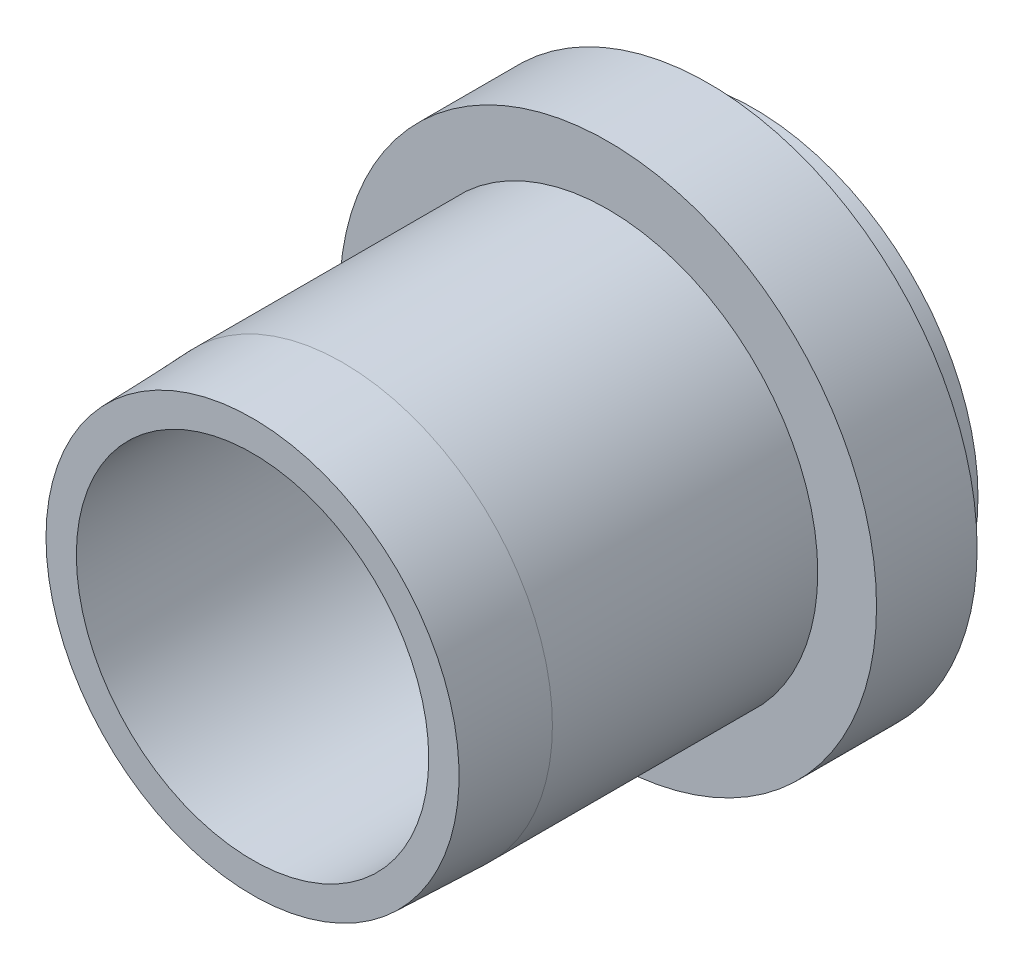
ISO-10303-21;
HEADER;
FILE_DESCRIPTION(('STEP AP214'),'2;1');
FILE_NAME('part.step','',(''),(''),'','','');
FILE_SCHEMA(('AUTOMOTIVE_DESIGN { 1 0 10303 214 1 1 1 1 }'));
ENDSEC;
DATA;
#1=APPLICATION_CONTEXT('core data for automotive mechanical design processes');
#2=APPLICATION_PROTOCOL_DEFINITION('international standard','automotive_design',2000,#1);
#3=PRODUCT_CONTEXT('',#1,'mechanical');
#4=PRODUCT('Part','Part','',(#3));
#5=PRODUCT_RELATED_PRODUCT_CATEGORY('part','',(#4));
#6=PRODUCT_DEFINITION_FORMATION('','',#4);
#7=PRODUCT_DEFINITION_CONTEXT('part definition',#1,'design');
#8=PRODUCT_DEFINITION('design','',#6,#7);
#9=PRODUCT_DEFINITION_SHAPE('','',#8);
#10=(LENGTH_UNIT() NAMED_UNIT(*) SI_UNIT(.MILLI.,.METRE.));
#11=(NAMED_UNIT(*) PLANE_ANGLE_UNIT() SI_UNIT($,.RADIAN.));
#12=(NAMED_UNIT(*) SI_UNIT($,.STERADIAN.) SOLID_ANGLE_UNIT());
#13=UNCERTAINTY_MEASURE_WITH_UNIT(LENGTH_MEASURE(1.E-05),#10,'distance_accuracy_value','');
#14=(GEOMETRIC_REPRESENTATION_CONTEXT(3) GLOBAL_UNCERTAINTY_ASSIGNED_CONTEXT((#13)) GLOBAL_UNIT_ASSIGNED_CONTEXT((#10,
#11,#12)) REPRESENTATION_CONTEXT('',''));
#15=CARTESIAN_POINT('',(0.,0.,0.));
#16=DIRECTION('',(0.,0.,1.));
#17=DIRECTION('',(1.,0.,0.));
#18=AXIS2_PLACEMENT_3D('',#15,#16,#17);
#19=CARTESIAN_POINT('',(0.,0.,14.45));
#20=DIRECTION('',(0.,0.,1.));
#21=DIRECTION('',(1.,0.,0.));
#22=AXIS2_PLACEMENT_3D('',#19,#20,#21);
#23=PLANE('',#22);
#24=CARTESIAN_POINT('',(0.,0.,14.45));
#25=DIRECTION('',(0.,0.,1.));
#26=DIRECTION('',(1.,0.,0.));
#27=AXIS2_PLACEMENT_3D('',#24,#25,#26);
#28=CIRCLE('',#27,5.08);
#29=CARTESIAN_POINT('',(5.08000000000001,0.,14.45));
#30=VERTEX_POINT('',#29);
#31=EDGE_CURVE('E58',#30,#30,#28,.T.);
#32=ORIENTED_EDGE('',*,*,#31,.F.);
#33=EDGE_LOOP('',(#32));
#34=FACE_BOUND('',#33,.T.);
#35=CARTESIAN_POINT('',(0.,0.,14.45));
#36=DIRECTION('',(0.,0.,-1.));
#37=DIRECTION('',(-1.,0.,0.));
#38=AXIS2_PLACEMENT_3D('',#35,#36,#37);
#39=CIRCLE('',#38,5.95440599932147);
#40=CARTESIAN_POINT('',(-5.95440599932147,0.,14.45));
#41=VERTEX_POINT('',#40);
#42=EDGE_CURVE('E122',#41,#41,#39,.T.);
#43=ORIENTED_EDGE('',*,*,#42,.F.);
#44=EDGE_LOOP('',(#43));
#45=FACE_BOUND('',#44,.T.);
#46=ADVANCED_FACE('F40',(#34,#45),#23,.T.);
#47=CARTESIAN_POINT('',(0.,0.,4.2));
#48=DIRECTION('',(0.,0.,-1.));
#49=DIRECTION('',(-1.,0.,0.));
#50=AXIS2_PLACEMENT_3D('',#47,#48,#49);
#51=CYLINDRICAL_SURFACE('',#50,6.465);
#52=CARTESIAN_POINT('',(0.,0.,0.));
#53=DIRECTION('',(0.,0.,1.));
#54=DIRECTION('',(1.,0.,0.));
#55=AXIS2_PLACEMENT_3D('',#52,#53,#54);
#56=CIRCLE('',#55,6.465);
#57=CARTESIAN_POINT('',(6.465,0.,0.));
#58=VERTEX_POINT('',#57);
#59=EDGE_CURVE('E55',#58,#58,#56,.T.);
#60=ORIENTED_EDGE('',*,*,#59,.T.);
#61=EDGE_LOOP('',(#60));
#62=FACE_BOUND('',#61,.T.);
#63=CARTESIAN_POINT('',(0.,0.,1.3));
#64=DIRECTION('',(0.,0.,1.));
#65=DIRECTION('',(1.,0.,0.));
#66=AXIS2_PLACEMENT_3D('',#63,#64,#65);
#67=CIRCLE('',#66,6.465);
#68=CARTESIAN_POINT('',(6.465,0.,1.3));
#69=VERTEX_POINT('',#68);
#70=EDGE_CURVE('E44',#69,#69,#67,.T.);
#71=ORIENTED_EDGE('',*,*,#70,.F.);
#72=EDGE_LOOP('',(#71));
#73=FACE_BOUND('',#72,.T.);
#74=ADVANCED_FACE('F42',(#62,#73),#51,.T.);
#75=CARTESIAN_POINT('',(0.,0.,0.));
#76=DIRECTION('',(0.,0.,1.));
#77=DIRECTION('',(1.,0.,0.));
#78=AXIS2_PLACEMENT_3D('',#75,#76,#77);
#79=PLANE('',#78);
#80=CARTESIAN_POINT('',(0.,0.,0.));
#81=DIRECTION('',(0.,0.,1.));
#82=DIRECTION('',(1.,0.,0.));
#83=AXIS2_PLACEMENT_3D('',#80,#81,#82);
#84=CIRCLE('',#83,5.08);
#85=CARTESIAN_POINT('',(5.08,0.,0.));
#86=VERTEX_POINT('',#85);
#87=EDGE_CURVE('E67',#86,#86,#84,.T.);
#88=ORIENTED_EDGE('',*,*,#87,.T.);
#89=EDGE_LOOP('',(#88));
#90=FACE_BOUND('',#89,.T.);
#91=ORIENTED_EDGE('',*,*,#59,.F.);
#92=EDGE_LOOP('',(#91));
#93=FACE_BOUND('',#92,.T.);
#94=ADVANCED_FACE('F75',(#90,#93),#79,.F.);
#95=CARTESIAN_POINT('',(0.,0.,1.3));
#96=DIRECTION('',(0.,0.,1.));
#97=DIRECTION('',(1.,0.,0.));
#98=AXIS2_PLACEMENT_3D('',#95,#96,#97);
#99=CYLINDRICAL_SURFACE('',#98,7.74);
#100=CARTESIAN_POINT('',(0.,0.,1.3));
#101=DIRECTION('',(0.,0.,1.));
#102=DIRECTION('',(1.,0.,0.));
#103=AXIS2_PLACEMENT_3D('',#100,#101,#102);
#104=CIRCLE('',#103,7.74);
#105=CARTESIAN_POINT('',(7.74,0.,1.3));
#106=VERTEX_POINT('',#105);
#107=EDGE_CURVE('E60',#106,#106,#104,.T.);
#108=ORIENTED_EDGE('',*,*,#107,.T.);
#109=EDGE_LOOP('',(#108));
#110=FACE_BOUND('',#109,.T.);
#111=CARTESIAN_POINT('',(0.,0.,4.2));
#112=DIRECTION('',(0.,0.,1.));
#113=DIRECTION('',(1.,0.,0.));
#114=AXIS2_PLACEMENT_3D('',#111,#112,#113);
#115=CIRCLE('',#114,7.74);
#116=CARTESIAN_POINT('',(7.74,0.,4.2));
#117=VERTEX_POINT('',#116);
#118=EDGE_CURVE('E64',#117,#117,#115,.T.);
#119=ORIENTED_EDGE('',*,*,#118,.F.);
#120=EDGE_LOOP('',(#119));
#121=FACE_BOUND('',#120,.T.);
#122=ADVANCED_FACE('F77',(#110,#121),#99,.T.);
#123=CARTESIAN_POINT('',(0.,0.,1.3));
#124=DIRECTION('',(0.,0.,1.));
#125=DIRECTION('',(1.,0.,0.));
#126=AXIS2_PLACEMENT_3D('',#123,#124,#125);
#127=PLANE('',#126);
#128=ORIENTED_EDGE('',*,*,#70,.T.);
#129=EDGE_LOOP('',(#128));
#130=FACE_BOUND('',#129,.T.);
#131=ORIENTED_EDGE('',*,*,#107,.F.);
#132=EDGE_LOOP('',(#131));
#133=FACE_BOUND('',#132,.T.);
#134=ADVANCED_FACE('F83',(#130,#133),#127,.F.);
#135=CARTESIAN_POINT('',(0.,0.,4.2));
#136=DIRECTION('',(0.,0.,1.));
#137=DIRECTION('',(1.,0.,0.));
#138=AXIS2_PLACEMENT_3D('',#135,#136,#137);
#139=PLANE('',#138);
#140=CARTESIAN_POINT('',(0.,0.,4.2));
#141=DIRECTION('',(0.,0.,1.));
#142=DIRECTION('',(1.,0.,0.));
#143=AXIS2_PLACEMENT_3D('',#140,#141,#142);
#144=CIRCLE('',#143,6.0452);
#145=CARTESIAN_POINT('',(6.0452,0.,4.2));
#146=VERTEX_POINT('',#145);
#147=EDGE_CURVE('E11',#146,#146,#144,.T.);
#148=ORIENTED_EDGE('',*,*,#147,.F.);
#149=EDGE_LOOP('',(#148));
#150=FACE_BOUND('',#149,.T.);
#151=ORIENTED_EDGE('',*,*,#118,.T.);
#152=EDGE_LOOP('',(#151));
#153=FACE_BOUND('',#152,.T.);
#154=ADVANCED_FACE('F100',(#150,#153),#139,.T.);
#155=CARTESIAN_POINT('',(0.,0.,45.9984076545157));
#156=DIRECTION('',(0.,0.,-1.));
#157=DIRECTION('',(-1.,0.,0.));
#158=AXIS2_PLACEMENT_3D('',#155,#156,#157);
#159=CYLINDRICAL_SURFACE('',#158,6.0452);
#160=CARTESIAN_POINT('',(0.,0.,11.85));
#161=DIRECTION('',(0.,0.,-1.));
#162=DIRECTION('',(-1.,0.,0.));
#163=AXIS2_PLACEMENT_3D('',#160,#161,#162);
#164=CIRCLE('',#163,6.0452);
#165=CARTESIAN_POINT('',(-6.0452,0.,11.85));
#166=VERTEX_POINT('',#165);
#167=EDGE_CURVE('E119',#166,#166,#164,.T.);
#168=ORIENTED_EDGE('',*,*,#167,.T.);
#169=EDGE_LOOP('',(#168));
#170=FACE_BOUND('',#169,.T.);
#171=ORIENTED_EDGE('',*,*,#147,.T.);
#172=EDGE_LOOP('',(#171));
#173=FACE_BOUND('',#172,.T.);
#174=ADVANCED_FACE('F97',(#170,#173),#159,.T.);
#175=CARTESIAN_POINT('',(0.,0.,0.));
#176=DIRECTION('',(0.,0.,1.));
#177=DIRECTION('',(1.,0.,0.));
#178=AXIS2_PLACEMENT_3D('',#175,#176,#177);
#179=CYLINDRICAL_SURFACE('',#178,5.08);
#180=ORIENTED_EDGE('',*,*,#87,.F.);
#181=EDGE_LOOP('',(#180));
#182=FACE_BOUND('',#181,.T.);
#183=ORIENTED_EDGE('',*,*,#31,.T.);
#184=EDGE_LOOP('',(#183));
#185=FACE_BOUND('',#184,.T.);
#186=ADVANCED_FACE('F107',(#182,#185),#179,.F.);
#187=CARTESIAN_POINT('',(0.,0.,14.45));
#188=DIRECTION('',(0.,0.,-1.));
#189=DIRECTION('',(-1.,0.,0.));
#190=AXIS2_PLACEMENT_3D('',#187,#188,#189);
#191=CONICAL_SURFACE('',#190,5.95440599932147,0.0349065850398795);
#192=ORIENTED_EDGE('',*,*,#167,.F.);
#193=EDGE_LOOP('',(#192));
#194=FACE_BOUND('',#193,.T.);
#195=ORIENTED_EDGE('',*,*,#42,.T.);
#196=EDGE_LOOP('',(#195));
#197=FACE_BOUND('',#196,.T.);
#198=ADVANCED_FACE('F115',(#194,#197),#191,.T.);
#199=CLOSED_SHELL('',(#46,#74,#94,#122,#134,#154,#174,#186,#198));
#200=MANIFOLD_SOLID_BREP('B2',#199);
#201=ADVANCED_BREP_SHAPE_REPRESENTATION('',(#18,#200),#14);
#202=SHAPE_DEFINITION_REPRESENTATION(#9,#201);
ENDSEC;
END-ISO-10303-21;
